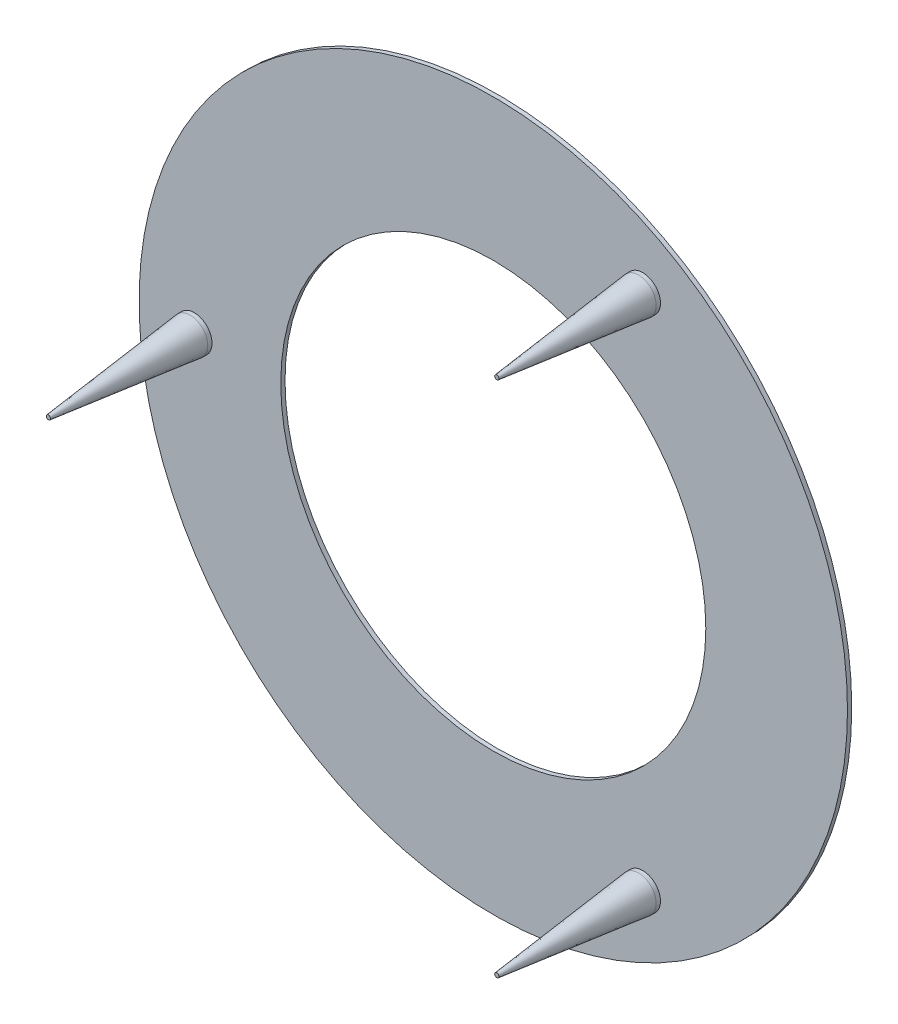
ISO-10303-21;
HEADER;
FILE_DESCRIPTION(('STEP AP214'),'2;1');
FILE_NAME('part.step','',(''),(''),'','','');
FILE_SCHEMA(('AUTOMOTIVE_DESIGN { 1 0 10303 214 1 1 1 1 }'));
ENDSEC;
DATA;
#1=APPLICATION_CONTEXT('core data for automotive mechanical design processes');
#2=APPLICATION_PROTOCOL_DEFINITION('international standard','automotive_design',2000,#1);
#3=PRODUCT_CONTEXT('',#1,'mechanical');
#4=PRODUCT('Part','Part','',(#3));
#5=PRODUCT_RELATED_PRODUCT_CATEGORY('part','',(#4));
#6=PRODUCT_DEFINITION_FORMATION('','',#4);
#7=PRODUCT_DEFINITION_CONTEXT('part definition',#1,'design');
#8=PRODUCT_DEFINITION('design','',#6,#7);
#9=PRODUCT_DEFINITION_SHAPE('','',#8);
#10=(LENGTH_UNIT() NAMED_UNIT(*) SI_UNIT(.MILLI.,.METRE.));
#11=(NAMED_UNIT(*) PLANE_ANGLE_UNIT() SI_UNIT($,.RADIAN.));
#12=(NAMED_UNIT(*) SI_UNIT($,.STERADIAN.) SOLID_ANGLE_UNIT());
#13=UNCERTAINTY_MEASURE_WITH_UNIT(LENGTH_MEASURE(1.E-05),#10,'distance_accuracy_value','');
#14=(GEOMETRIC_REPRESENTATION_CONTEXT(3) GLOBAL_UNCERTAINTY_ASSIGNED_CONTEXT((#13)) GLOBAL_UNIT_ASSIGNED_CONTEXT((#10,
#11,#12)) REPRESENTATION_CONTEXT('',''));
#15=CARTESIAN_POINT('',(0.,0.,0.));
#16=DIRECTION('',(0.,0.,1.));
#17=DIRECTION('',(1.,0.,0.));
#18=AXIS2_PLACEMENT_3D('',#15,#16,#17);
#19=CARTESIAN_POINT('',(0.,0.,0.762));
#20=DIRECTION('',(0.,0.,1.));
#21=DIRECTION('',(1.,0.,0.));
#22=AXIS2_PLACEMENT_3D('',#19,#20,#21);
#23=PLANE('',#22);
#24=CARTESIAN_POINT('',(26.798643667455,-46.4166124059655,0.762));
#25=DIRECTION('',(0.,0.,1.));
#26=DIRECTION('',(-0.500000000000004,0.866025403784436,0.));
#27=AXIS2_PLACEMENT_3D('',#24,#25,#26);
#28=CIRCLE('',#27,3.175);
#29=CARTESIAN_POINT('',(25.211143667455,-43.6669817489499,0.762));
#30=VERTEX_POINT('',#29);
#31=EDGE_CURVE('E72',#30,#30,#28,.T.);
#32=ORIENTED_EDGE('',*,*,#31,.F.);
#33=EDGE_LOOP('',(#32));
#34=FACE_BOUND('',#33,.T.);
#35=CARTESIAN_POINT('',(0.,0.,0.762));
#36=DIRECTION('',(0.,0.,1.));
#37=DIRECTION('',(1.,0.,0.));
#38=AXIS2_PLACEMENT_3D('',#35,#36,#37);
#39=CIRCLE('',#38,38.1);
#40=CARTESIAN_POINT('',(38.1,0.,0.762));
#41=VERTEX_POINT('',#40);
#42=EDGE_CURVE('E61',#41,#41,#39,.T.);
#43=ORIENTED_EDGE('',*,*,#42,.F.);
#44=EDGE_LOOP('',(#43));
#45=FACE_BOUND('',#44,.T.);
#46=CARTESIAN_POINT('',(0.,0.,0.762));
#47=DIRECTION('',(0.,0.,1.));
#48=DIRECTION('',(1.,0.,0.));
#49=AXIS2_PLACEMENT_3D('',#46,#47,#48);
#50=CIRCLE('',#49,63.5);
#51=CARTESIAN_POINT('',(63.5,0.,0.762));
#52=VERTEX_POINT('',#51);
#53=EDGE_CURVE('E57',#52,#52,#50,.T.);
#54=ORIENTED_EDGE('',*,*,#53,.T.);
#55=EDGE_LOOP('',(#54));
#56=FACE_BOUND('',#55,.T.);
#57=CARTESIAN_POINT('',(-53.5972873349095,0.,0.762));
#58=DIRECTION('',(0.,0.,1.));
#59=DIRECTION('',(1.,0.,0.));
#60=AXIS2_PLACEMENT_3D('',#57,#58,#59);
#61=CIRCLE('',#60,3.175);
#62=CARTESIAN_POINT('',(-50.4222873349095,0.,0.762));
#63=VERTEX_POINT('',#62);
#64=EDGE_CURVE('E67',#63,#63,#61,.T.);
#65=ORIENTED_EDGE('',*,*,#64,.F.);
#66=EDGE_LOOP('',(#65));
#67=FACE_BOUND('',#66,.T.);
#68=CARTESIAN_POINT('',(26.7986436674543,46.4166124059659,0.762));
#69=DIRECTION('',(0.,0.,1.));
#70=DIRECTION('',(-0.499999999999992,-0.866025403784443,0.));
#71=AXIS2_PLACEMENT_3D('',#68,#69,#70);
#72=CIRCLE('',#71,3.175);
#73=CARTESIAN_POINT('',(25.2111436674544,43.6669817489503,0.762));
#74=VERTEX_POINT('',#73);
#75=EDGE_CURVE('E75',#74,#74,#72,.T.);
#76=ORIENTED_EDGE('',*,*,#75,.F.);
#77=EDGE_LOOP('',(#76));
#78=FACE_BOUND('',#77,.T.);
#79=ADVANCED_FACE('F31',(#34,#45,#56,#67,#78),#23,.T.);
#80=CARTESIAN_POINT('',(0.,0.,0.));
#81=DIRECTION('',(0.,0.,1.));
#82=DIRECTION('',(1.,0.,0.));
#83=AXIS2_PLACEMENT_3D('',#80,#81,#82);
#84=PLANE('',#83);
#85=CARTESIAN_POINT('',(0.,0.,0.));
#86=DIRECTION('',(0.,0.,1.));
#87=DIRECTION('',(1.,0.,0.));
#88=AXIS2_PLACEMENT_3D('',#85,#86,#87);
#89=CIRCLE('',#88,63.5);
#90=CARTESIAN_POINT('',(63.5,0.,0.));
#91=VERTEX_POINT('',#90);
#92=EDGE_CURVE('E58',#91,#91,#89,.T.);
#93=ORIENTED_EDGE('',*,*,#92,.F.);
#94=EDGE_LOOP('',(#93));
#95=FACE_BOUND('',#94,.T.);
#96=CARTESIAN_POINT('',(0.,0.,0.));
#97=DIRECTION('',(0.,0.,1.));
#98=DIRECTION('',(1.,0.,0.));
#99=AXIS2_PLACEMENT_3D('',#96,#97,#98);
#100=CIRCLE('',#99,38.1);
#101=CARTESIAN_POINT('',(38.1,0.,0.));
#102=VERTEX_POINT('',#101);
#103=EDGE_CURVE('E64',#102,#102,#100,.T.);
#104=ORIENTED_EDGE('',*,*,#103,.T.);
#105=EDGE_LOOP('',(#104));
#106=FACE_BOUND('',#105,.T.);
#107=ADVANCED_FACE('F82',(#95,#106),#84,.F.);
#108=CARTESIAN_POINT('',(0.,0.,0.762));
#109=DIRECTION('',(0.,0.,-1.));
#110=DIRECTION('',(-1.,0.,0.));
#111=AXIS2_PLACEMENT_3D('',#108,#109,#110);
#112=CYLINDRICAL_SURFACE('',#111,63.5);
#113=ORIENTED_EDGE('',*,*,#53,.F.);
#114=EDGE_LOOP('',(#113));
#115=FACE_BOUND('',#114,.T.);
#116=ORIENTED_EDGE('',*,*,#92,.T.);
#117=EDGE_LOOP('',(#116));
#118=FACE_BOUND('',#117,.T.);
#119=ADVANCED_FACE('F88',(#115,#118),#112,.T.);
#120=CARTESIAN_POINT('',(0.,0.,0.762));
#121=DIRECTION('',(0.,0.,-1.));
#122=DIRECTION('',(-1.,0.,0.));
#123=AXIS2_PLACEMENT_3D('',#120,#121,#122);
#124=CYLINDRICAL_SURFACE('',#123,38.1);
#125=ORIENTED_EDGE('',*,*,#42,.T.);
#126=EDGE_LOOP('',(#125));
#127=FACE_BOUND('',#126,.T.);
#128=ORIENTED_EDGE('',*,*,#103,.F.);
#129=EDGE_LOOP('',(#128));
#130=FACE_BOUND('',#129,.T.);
#131=ADVANCED_FACE('F94',(#127,#130),#124,.F.);
#132=CARTESIAN_POINT('',(-53.5972873349095,0.,26.924));
#133=DIRECTION('',(0.,0.,-1.));
#134=DIRECTION('',(-1.,0.,0.));
#135=AXIS2_PLACEMENT_3D('',#132,#133,#134);
#136=CYLINDRICAL_SURFACE('',#135,3.175);
#137=CARTESIAN_POINT('',(-53.5972873349095,0.,1.5240000000025));
#138=DIRECTION('',(0.,0.,1.));
#139=DIRECTION('',(1.,0.,0.));
#140=AXIS2_PLACEMENT_3D('',#137,#138,#139);
#141=CIRCLE('',#140,3.175);
#142=CARTESIAN_POINT('',(-50.4222873349095,0.,1.5240000000025));
#143=VERTEX_POINT('',#142);
#144=EDGE_CURVE('E51',#143,#143,#141,.F.);
#145=ORIENTED_EDGE('',*,*,#144,.T.);
#146=EDGE_LOOP('',(#145));
#147=FACE_BOUND('',#146,.T.);
#148=ORIENTED_EDGE('',*,*,#64,.T.);
#149=EDGE_LOOP('',(#148));
#150=FACE_BOUND('',#149,.T.);
#151=ADVANCED_FACE('F131',(#147,#150),#136,.T.);
#152=CARTESIAN_POINT('',(-53.5972873349095,0.,26.924));
#153=DIRECTION('',(0.,0.,1.));
#154=DIRECTION('',(1.,0.,0.));
#155=AXIS2_PLACEMENT_3D('',#152,#153,#154);
#156=PLANE('',#155);
#157=CARTESIAN_POINT('',(-53.5972873349095,0.,26.924));
#158=DIRECTION('',(0.,0.,1.));
#159=DIRECTION('',(1.,0.,0.));
#160=AXIS2_PLACEMENT_3D('',#157,#158,#159);
#161=CIRCLE('',#160,0.381000000000367);
#162=CARTESIAN_POINT('',(-53.2162873349092,0.,26.924));
#163=VERTEX_POINT('',#162);
#164=EDGE_CURVE('E54',#163,#163,#161,.T.);
#165=ORIENTED_EDGE('',*,*,#164,.T.);
#166=EDGE_LOOP('',(#165));
#167=FACE_BOUND('',#166,.T.);
#168=ADVANCED_FACE('F103',(#167),#156,.T.);
#169=CARTESIAN_POINT('',(-53.5972873349095,0.,26.924));
#170=DIRECTION('',(0.,0.,-1.));
#171=DIRECTION('',(-1.,0.,0.));
#172=AXIS2_PLACEMENT_3D('',#169,#170,#171);
#173=CONICAL_SURFACE('',#172,0.381000000000367,0.109559526773941);
#174=ORIENTED_EDGE('',*,*,#144,.F.);
#175=EDGE_LOOP('',(#174));
#176=FACE_BOUND('',#175,.T.);
#177=ORIENTED_EDGE('',*,*,#164,.F.);
#178=EDGE_LOOP('',(#177));
#179=FACE_BOUND('',#178,.T.);
#180=ADVANCED_FACE('F100',(#176,#179),#173,.T.);
#181=CARTESIAN_POINT('',(26.798643667455,-46.4166124059655,26.924));
#182=DIRECTION('',(0.,0.,-1.));
#183=DIRECTION('',(-1.,0.,0.));
#184=AXIS2_PLACEMENT_3D('',#181,#182,#183);
#185=CYLINDRICAL_SURFACE('',#184,3.175);
#186=CARTESIAN_POINT('',(26.798643667455,-46.4166124059655,1.52400000000088));
#187=DIRECTION('',(0.,0.,1.));
#188=DIRECTION('',(1.,0.,0.));
#189=AXIS2_PLACEMENT_3D('',#186,#187,#188);
#190=CIRCLE('',#189,3.175);
#191=CARTESIAN_POINT('',(29.973643667455,-46.4166124059655,1.52400000000088));
#192=VERTEX_POINT('',#191);
#193=EDGE_CURVE('E42',#192,#192,#190,.F.);
#194=ORIENTED_EDGE('',*,*,#193,.T.);
#195=EDGE_LOOP('',(#194));
#196=FACE_BOUND('',#195,.T.);
#197=ORIENTED_EDGE('',*,*,#31,.T.);
#198=EDGE_LOOP('',(#197));
#199=FACE_BOUND('',#198,.T.);
#200=ADVANCED_FACE('F102',(#196,#199),#185,.T.);
#201=CARTESIAN_POINT('',(26.798643667455,-46.4166124059655,26.924));
#202=DIRECTION('',(0.,0.,1.));
#203=DIRECTION('',(-0.500000000000004,0.866025403784436,0.));
#204=AXIS2_PLACEMENT_3D('',#201,#202,#203);
#205=PLANE('',#204);
#206=CARTESIAN_POINT('',(26.798643667455,-46.4166124059655,26.924));
#207=DIRECTION('',(0.,0.,1.));
#208=DIRECTION('',(1.,0.,0.));
#209=AXIS2_PLACEMENT_3D('',#206,#207,#208);
#210=CIRCLE('',#209,0.381000000000177);
#211=CARTESIAN_POINT('',(27.1796436674552,-46.4166124059655,26.924));
#212=VERTEX_POINT('',#211);
#213=EDGE_CURVE('E46',#212,#212,#210,.T.);
#214=ORIENTED_EDGE('',*,*,#213,.T.);
#215=EDGE_LOOP('',(#214));
#216=FACE_BOUND('',#215,.T.);
#217=ADVANCED_FACE('F119',(#216),#205,.T.);
#218=CARTESIAN_POINT('',(26.7986436674543,46.4166124059659,26.924));
#219=DIRECTION('',(0.,0.,-1.));
#220=DIRECTION('',(-1.,0.,0.));
#221=AXIS2_PLACEMENT_3D('',#218,#219,#220);
#222=CYLINDRICAL_SURFACE('',#221,3.175);
#223=CARTESIAN_POINT('',(26.7986436674543,46.4166124059659,1.52400000000187));
#224=DIRECTION('',(0.,0.,1.));
#225=DIRECTION('',(1.,0.,0.));
#226=AXIS2_PLACEMENT_3D('',#223,#224,#225);
#227=CIRCLE('',#226,3.175);
#228=CARTESIAN_POINT('',(29.9736436674543,46.4166124059659,1.52400000000187));
#229=VERTEX_POINT('',#228);
#230=EDGE_CURVE('E10',#229,#229,#227,.F.);
#231=ORIENTED_EDGE('',*,*,#230,.T.);
#232=EDGE_LOOP('',(#231));
#233=FACE_BOUND('',#232,.T.);
#234=ORIENTED_EDGE('',*,*,#75,.T.);
#235=EDGE_LOOP('',(#234));
#236=FACE_BOUND('',#235,.T.);
#237=ADVANCED_FACE('F79',(#233,#236),#222,.T.);
#238=CARTESIAN_POINT('',(26.7986436674543,46.4166124059659,26.924));
#239=DIRECTION('',(0.,0.,1.));
#240=DIRECTION('',(-0.499999999999992,-0.866025403784443,0.));
#241=AXIS2_PLACEMENT_3D('',#238,#239,#240);
#242=PLANE('',#241);
#243=CARTESIAN_POINT('',(26.7986436674543,46.4166124059659,26.924));
#244=DIRECTION('',(0.,0.,1.));
#245=DIRECTION('',(1.,0.,0.));
#246=AXIS2_PLACEMENT_3D('',#243,#244,#245);
#247=CIRCLE('',#246,0.381000000000295);
#248=CARTESIAN_POINT('',(27.1796436674546,46.4166124059659,26.924));
#249=VERTEX_POINT('',#248);
#250=EDGE_CURVE('E38',#249,#249,#247,.T.);
#251=ORIENTED_EDGE('',*,*,#250,.T.);
#252=EDGE_LOOP('',(#251));
#253=FACE_BOUND('',#252,.T.);
#254=ADVANCED_FACE('F107',(#253),#242,.T.);
#255=CARTESIAN_POINT('',(26.798643667455,-46.4166124059655,26.924));
#256=DIRECTION('',(0.,0.,-1.));
#257=DIRECTION('',(-1.,0.,0.));
#258=AXIS2_PLACEMENT_3D('',#255,#256,#257);
#259=CONICAL_SURFACE('',#258,0.381000000000178,0.109559526773941);
#260=ORIENTED_EDGE('',*,*,#193,.F.);
#261=EDGE_LOOP('',(#260));
#262=FACE_BOUND('',#261,.T.);
#263=ORIENTED_EDGE('',*,*,#213,.F.);
#264=EDGE_LOOP('',(#263));
#265=FACE_BOUND('',#264,.T.);
#266=ADVANCED_FACE('F105',(#262,#265),#259,.T.);
#267=CARTESIAN_POINT('',(26.7986436674543,46.4166124059659,26.924));
#268=DIRECTION('',(0.,0.,-1.));
#269=DIRECTION('',(-1.,0.,0.));
#270=AXIS2_PLACEMENT_3D('',#267,#268,#269);
#271=CONICAL_SURFACE('',#270,0.381000000000295,0.109559526773941);
#272=ORIENTED_EDGE('',*,*,#230,.F.);
#273=EDGE_LOOP('',(#272));
#274=FACE_BOUND('',#273,.T.);
#275=ORIENTED_EDGE('',*,*,#250,.F.);
#276=EDGE_LOOP('',(#275));
#277=FACE_BOUND('',#276,.T.);
#278=ADVANCED_FACE('F33',(#274,#277),#271,.T.);
#279=CLOSED_SHELL('',(#79,#107,#119,#131,#151,#168,#180,#200,#217,#237,#254,#266,#278));
#280=MANIFOLD_SOLID_BREP('B2',#279);
#281=ADVANCED_BREP_SHAPE_REPRESENTATION('',(#18,#280),#14);
#282=SHAPE_DEFINITION_REPRESENTATION(#9,#281);
ENDSEC;
END-ISO-10303-21;
